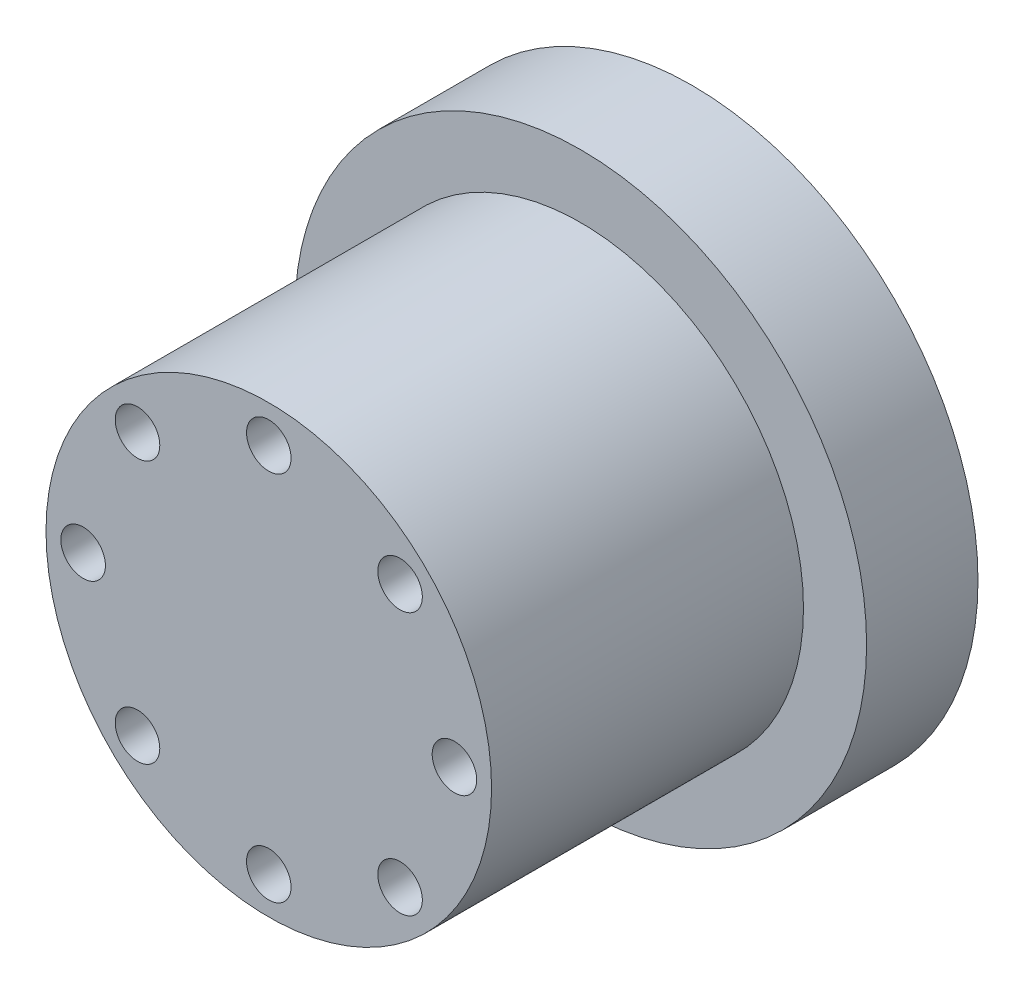
ISO-10303-21;
HEADER;
FILE_DESCRIPTION(('STEP AP214'),'2;1');
FILE_NAME('part.step','',(''),(''),'','','');
FILE_SCHEMA(('AUTOMOTIVE_DESIGN { 1 0 10303 214 1 1 1 1 }'));
ENDSEC;
DATA;
#1=APPLICATION_CONTEXT('core data for automotive mechanical design processes');
#2=APPLICATION_PROTOCOL_DEFINITION('international standard','automotive_design',2000,#1);
#3=PRODUCT_CONTEXT('',#1,'mechanical');
#4=PRODUCT('Part','Part','',(#3));
#5=PRODUCT_RELATED_PRODUCT_CATEGORY('part','',(#4));
#6=PRODUCT_DEFINITION_FORMATION('','',#4);
#7=PRODUCT_DEFINITION_CONTEXT('part definition',#1,'design');
#8=PRODUCT_DEFINITION('design','',#6,#7);
#9=PRODUCT_DEFINITION_SHAPE('','',#8);
#10=(LENGTH_UNIT() NAMED_UNIT(*) SI_UNIT(.MILLI.,.METRE.));
#11=(NAMED_UNIT(*) PLANE_ANGLE_UNIT() SI_UNIT($,.RADIAN.));
#12=(NAMED_UNIT(*) SI_UNIT($,.STERADIAN.) SOLID_ANGLE_UNIT());
#13=UNCERTAINTY_MEASURE_WITH_UNIT(LENGTH_MEASURE(1.E-05),#10,'distance_accuracy_value','');
#14=(GEOMETRIC_REPRESENTATION_CONTEXT(3) GLOBAL_UNCERTAINTY_ASSIGNED_CONTEXT((#13)) GLOBAL_UNIT_ASSIGNED_CONTEXT((#10,
#11,#12)) REPRESENTATION_CONTEXT('',''));
#15=CARTESIAN_POINT('',(0.,0.,0.));
#16=DIRECTION('',(0.,0.,1.));
#17=DIRECTION('',(1.,0.,0.));
#18=AXIS2_PLACEMENT_3D('',#15,#16,#17);
#19=CARTESIAN_POINT('',(0.,0.,42.));
#20=DIRECTION('',(0.,0.,-1.));
#21=DIRECTION('',(-1.,0.,0.));
#22=AXIS2_PLACEMENT_3D('',#19,#20,#21);
#23=CYLINDRICAL_SURFACE('',#22,30.);
#24=CARTESIAN_POINT('',(0.,0.,42.));
#25=DIRECTION('',(0.,0.,1.));
#26=DIRECTION('',(1.,0.,0.));
#27=AXIS2_PLACEMENT_3D('',#24,#25,#26);
#28=CIRCLE('',#27,30.);
#29=CARTESIAN_POINT('',(30.,0.,42.));
#30=VERTEX_POINT('',#29);
#31=EDGE_CURVE('E10',#30,#30,#28,.T.);
#32=ORIENTED_EDGE('',*,*,#31,.F.);
#33=EDGE_LOOP('',(#32));
#34=FACE_BOUND('',#33,.T.);
#35=CARTESIAN_POINT('',(0.,0.,0.));
#36=DIRECTION('',(0.,0.,1.));
#37=DIRECTION('',(1.,0.,0.));
#38=AXIS2_PLACEMENT_3D('',#35,#36,#37);
#39=CIRCLE('',#38,30.);
#40=CARTESIAN_POINT('',(30.,0.,0.));
#41=VERTEX_POINT('',#40);
#42=EDGE_CURVE('E37',#41,#41,#39,.T.);
#43=ORIENTED_EDGE('',*,*,#42,.T.);
#44=EDGE_LOOP('',(#43));
#45=FACE_BOUND('',#44,.T.);
#46=ADVANCED_FACE('F34',(#34,#45),#23,.T.);
#47=CARTESIAN_POINT('',(0.,0.,42.));
#48=DIRECTION('',(0.,0.,1.));
#49=DIRECTION('',(1.,0.,0.));
#50=AXIS2_PLACEMENT_3D('',#47,#48,#49);
#51=PLANE('',#50);
#52=CARTESIAN_POINT('',(0.,24.9999999999994,42.));
#53=DIRECTION('',(0.,0.,1.));
#54=DIRECTION('',(1.,0.,0.));
#55=AXIS2_PLACEMENT_3D('',#52,#53,#54);
#56=CIRCLE('',#55,3.);
#57=CARTESIAN_POINT('',(2.99999999999994,24.9999999999994,42.));
#58=VERTEX_POINT('',#57);
#59=EDGE_CURVE('E118',#58,#58,#56,.T.);
#60=ORIENTED_EDGE('',*,*,#59,.F.);
#61=EDGE_LOOP('',(#60));
#62=FACE_BOUND('',#61,.T.);
#63=CARTESIAN_POINT('',(17.6776695296635,17.6776695296639,42.));
#64=DIRECTION('',(0.,0.,1.));
#65=DIRECTION('',(1.,0.,0.));
#66=AXIS2_PLACEMENT_3D('',#63,#64,#65);
#67=CIRCLE('',#66,3.);
#68=CARTESIAN_POINT('',(20.6776695296635,17.6776695296639,42.));
#69=VERTEX_POINT('',#68);
#70=EDGE_CURVE('E112',#69,#69,#67,.T.);
#71=ORIENTED_EDGE('',*,*,#70,.F.);
#72=EDGE_LOOP('',(#71));
#73=FACE_BOUND('',#72,.T.);
#74=CARTESIAN_POINT('',(25.0000000000003,9.15325304873969E-13,42.));
#75=DIRECTION('',(0.,0.,1.));
#76=DIRECTION('',(1.,0.,0.));
#77=AXIS2_PLACEMENT_3D('',#74,#75,#76);
#78=CIRCLE('',#77,3.);
#79=CARTESIAN_POINT('',(28.0000000000003,9.15325304873969E-13,42.));
#80=VERTEX_POINT('',#79);
#81=EDGE_CURVE('E106',#80,#80,#78,.T.);
#82=ORIENTED_EDGE('',*,*,#81,.F.);
#83=EDGE_LOOP('',(#82));
#84=FACE_BOUND('',#83,.T.);
#85=CARTESIAN_POINT('',(17.6776695296648,-17.6776695296626,42.));
#86=DIRECTION('',(0.,0.,1.));
#87=DIRECTION('',(1.,0.,0.));
#88=AXIS2_PLACEMENT_3D('',#85,#86,#87);
#89=CIRCLE('',#88,3.);
#90=CARTESIAN_POINT('',(20.6776695296648,-17.6776695296626,42.));
#91=VERTEX_POINT('',#90);
#92=EDGE_CURVE('E100',#91,#91,#89,.T.);
#93=ORIENTED_EDGE('',*,*,#92,.F.);
#94=EDGE_LOOP('',(#93));
#95=FACE_BOUND('',#94,.T.);
#96=CARTESIAN_POINT('',(1.76583345588758E-12,-24.9999999999994,42.));
#97=DIRECTION('',(0.,0.,1.));
#98=DIRECTION('',(1.,0.,0.));
#99=AXIS2_PLACEMENT_3D('',#96,#97,#98);
#100=CIRCLE('',#99,3.);
#101=CARTESIAN_POINT('',(3.00000000000177,-24.9999999999994,42.));
#102=VERTEX_POINT('',#101);
#103=EDGE_CURVE('E94',#102,#102,#100,.T.);
#104=ORIENTED_EDGE('',*,*,#103,.F.);
#105=EDGE_LOOP('',(#104));
#106=FACE_BOUND('',#105,.T.);
#107=CARTESIAN_POINT('',(-17.6776695296618,-17.6776695296639,42.));
#108=DIRECTION('',(0.,0.,1.));
#109=DIRECTION('',(1.,0.,0.));
#110=AXIS2_PLACEMENT_3D('',#107,#108,#109);
#111=CIRCLE('',#110,3.);
#112=CARTESIAN_POINT('',(-14.6776695296618,-17.6776695296639,42.));
#113=VERTEX_POINT('',#112);
#114=EDGE_CURVE('E88',#113,#113,#111,.T.);
#115=ORIENTED_EDGE('',*,*,#114,.F.);
#116=EDGE_LOOP('',(#115));
#117=FACE_BOUND('',#116,.T.);
#118=CARTESIAN_POINT('',(-24.9999999999986,-9.18386921871838E-13,42.));
#119=DIRECTION('',(0.,0.,1.));
#120=DIRECTION('',(1.,0.,0.));
#121=AXIS2_PLACEMENT_3D('',#118,#119,#120);
#122=CIRCLE('',#121,3.);
#123=CARTESIAN_POINT('',(-21.9999999999985,-9.18386921871838E-13,42.));
#124=VERTEX_POINT('',#123);
#125=EDGE_CURVE('E82',#124,#124,#122,.T.);
#126=ORIENTED_EDGE('',*,*,#125,.F.);
#127=EDGE_LOOP('',(#126));
#128=FACE_BOUND('',#127,.T.);
#129=CARTESIAN_POINT('',(-17.6776695296631,17.6776695296626,42.));
#130=DIRECTION('',(0.,0.,1.));
#131=DIRECTION('',(1.,0.,0.));
#132=AXIS2_PLACEMENT_3D('',#129,#130,#131);
#133=CIRCLE('',#132,3.);
#134=CARTESIAN_POINT('',(-14.6776695296631,17.6776695296626,42.));
#135=VERTEX_POINT('',#134);
#136=EDGE_CURVE('E76',#135,#135,#133,.T.);
#137=ORIENTED_EDGE('',*,*,#136,.F.);
#138=EDGE_LOOP('',(#137));
#139=FACE_BOUND('',#138,.T.);
#140=ORIENTED_EDGE('',*,*,#31,.T.);
#141=EDGE_LOOP('',(#140));
#142=FACE_BOUND('',#141,.T.);
#143=ADVANCED_FACE('F133',(#62,#73,#84,#95,#106,#117,#128,#139,#142),#51,.T.);
#144=CARTESIAN_POINT('',(0.,0.,-15.));
#145=DIRECTION('',(0.,0.,1.));
#146=DIRECTION('',(1.,0.,0.));
#147=AXIS2_PLACEMENT_3D('',#144,#145,#146);
#148=CYLINDRICAL_SURFACE('',#147,38.5);
#149=CARTESIAN_POINT('',(0.,0.,-15.));
#150=DIRECTION('',(0.,0.,1.));
#151=DIRECTION('',(1.,0.,0.));
#152=AXIS2_PLACEMENT_3D('',#149,#150,#151);
#153=CIRCLE('',#152,38.5);
#154=CARTESIAN_POINT('',(38.5,0.,-15.));
#155=VERTEX_POINT('',#154);
#156=EDGE_CURVE('E44',#155,#155,#153,.T.);
#157=ORIENTED_EDGE('',*,*,#156,.T.);
#158=EDGE_LOOP('',(#157));
#159=FACE_BOUND('',#158,.T.);
#160=CARTESIAN_POINT('',(0.,0.,0.));
#161=DIRECTION('',(0.,0.,1.));
#162=DIRECTION('',(1.,0.,0.));
#163=AXIS2_PLACEMENT_3D('',#160,#161,#162);
#164=CIRCLE('',#163,38.5);
#165=CARTESIAN_POINT('',(38.5,0.,0.));
#166=VERTEX_POINT('',#165);
#167=EDGE_CURVE('E46',#166,#166,#164,.T.);
#168=ORIENTED_EDGE('',*,*,#167,.F.);
#169=EDGE_LOOP('',(#168));
#170=FACE_BOUND('',#169,.T.);
#171=ADVANCED_FACE('F136',(#159,#170),#148,.T.);
#172=CARTESIAN_POINT('',(0.,0.,-15.));
#173=DIRECTION('',(0.,0.,1.));
#174=DIRECTION('',(1.,0.,0.));
#175=AXIS2_PLACEMENT_3D('',#172,#173,#174);
#176=PLANE('',#175);
#177=CARTESIAN_POINT('',(0.,25.,-15.));
#178=DIRECTION('',(0.,0.,-1.));
#179=DIRECTION('',(-1.,0.,0.));
#180=AXIS2_PLACEMENT_3D('',#177,#178,#179);
#181=CIRCLE('',#180,3.);
#182=CARTESIAN_POINT('',(-3.,25.,-15.));
#183=VERTEX_POINT('',#182);
#184=EDGE_CURVE('E71',#183,#183,#181,.T.);
#185=ORIENTED_EDGE('',*,*,#184,.F.);
#186=EDGE_LOOP('',(#185));
#187=FACE_BOUND('',#186,.T.);
#188=CARTESIAN_POINT('',(-25.0000000000007,7.07481118762232E-13,-15.));
#189=DIRECTION('',(0.,0.,-1.));
#190=DIRECTION('',(-1.,0.,0.));
#191=AXIS2_PLACEMENT_3D('',#188,#189,#190);
#192=CIRCLE('',#191,3.00000000000055);
#193=CARTESIAN_POINT('',(-28.0000000000013,7.07481118762232E-13,-15.));
#194=VERTEX_POINT('',#193);
#195=EDGE_CURVE('E65',#194,#194,#192,.T.);
#196=ORIENTED_EDGE('',*,*,#195,.F.);
#197=EDGE_LOOP('',(#196));
#198=FACE_BOUND('',#197,.T.);
#199=CARTESIAN_POINT('',(-1.41496223752446E-12,-25.,-15.));
#200=DIRECTION('',(0.,0.,-1.));
#201=DIRECTION('',(-1.,0.,0.));
#202=AXIS2_PLACEMENT_3D('',#199,#200,#201);
#203=CIRCLE('',#202,3.00000000000152);
#204=CARTESIAN_POINT('',(-3.00000000000294,-25.,-15.));
#205=VERTEX_POINT('',#204);
#206=EDGE_CURVE('E59',#205,#205,#203,.T.);
#207=ORIENTED_EDGE('',*,*,#206,.F.);
#208=EDGE_LOOP('',(#207));
#209=FACE_BOUND('',#208,.T.);
#210=CARTESIAN_POINT('',(24.9999999999993,-7.105427357601E-13,-15.));
#211=DIRECTION('',(0.,0.,-1.));
#212=DIRECTION('',(-1.,0.,0.));
#213=AXIS2_PLACEMENT_3D('',#210,#211,#212);
#214=CIRCLE('',#213,3.00000000000113);
#215=CARTESIAN_POINT('',(21.9999999999982,-7.105427357601E-13,-15.));
#216=VERTEX_POINT('',#215);
#217=EDGE_CURVE('E52',#216,#216,#214,.T.);
#218=ORIENTED_EDGE('',*,*,#217,.F.);
#219=EDGE_LOOP('',(#218));
#220=FACE_BOUND('',#219,.T.);
#221=ORIENTED_EDGE('',*,*,#156,.F.);
#222=EDGE_LOOP('',(#221));
#223=FACE_BOUND('',#222,.T.);
#224=ADVANCED_FACE('F179',(#187,#198,#209,#220,#223),#176,.F.);
#225=CARTESIAN_POINT('',(0.,0.,0.));
#226=DIRECTION('',(0.,0.,1.));
#227=DIRECTION('',(1.,0.,0.));
#228=AXIS2_PLACEMENT_3D('',#225,#226,#227);
#229=PLANE('',#228);
#230=ORIENTED_EDGE('',*,*,#42,.F.);
#231=EDGE_LOOP('',(#230));
#232=FACE_BOUND('',#231,.T.);
#233=ORIENTED_EDGE('',*,*,#167,.T.);
#234=EDGE_LOOP('',(#233));
#235=FACE_BOUND('',#234,.T.);
#236=ADVANCED_FACE('F175',(#232,#235),#229,.T.);
#237=CARTESIAN_POINT('',(24.9999999999993,-7.105427357601E-13,-5.));
#238=DIRECTION('',(0.,0.,-1.));
#239=DIRECTION('',(-1.,0.,0.));
#240=AXIS2_PLACEMENT_3D('',#237,#238,#239);
#241=CYLINDRICAL_SURFACE('',#240,3.00000000000113);
#242=CARTESIAN_POINT('',(24.9999999999993,-7.105427357601E-13,-5.));
#243=DIRECTION('',(0.,0.,-1.));
#244=DIRECTION('',(-1.,0.,0.));
#245=AXIS2_PLACEMENT_3D('',#242,#243,#244);
#246=CIRCLE('',#245,3.00000000000113);
#247=CARTESIAN_POINT('',(21.9999999999982,-7.105427357601E-13,-5.));
#248=VERTEX_POINT('',#247);
#249=EDGE_CURVE('E55',#248,#248,#246,.T.);
#250=ORIENTED_EDGE('',*,*,#249,.F.);
#251=EDGE_LOOP('',(#250));
#252=FACE_BOUND('',#251,.T.);
#253=ORIENTED_EDGE('',*,*,#217,.T.);
#254=EDGE_LOOP('',(#253));
#255=FACE_BOUND('',#254,.T.);
#256=ADVANCED_FACE('F178',(#252,#255),#241,.F.);
#257=CARTESIAN_POINT('',(24.9999999999993,-7.105427357601E-13,-5.));
#258=DIRECTION('',(0.,0.,-1.));
#259=DIRECTION('',(-1.,0.,0.));
#260=AXIS2_PLACEMENT_3D('',#257,#258,#259);
#261=PLANE('',#260);
#262=ORIENTED_EDGE('',*,*,#249,.T.);
#263=EDGE_LOOP('',(#262));
#264=FACE_BOUND('',#263,.T.);
#265=ADVANCED_FACE('F194',(#264),#261,.T.);
#266=CARTESIAN_POINT('',(-1.41496223752446E-12,-25.,-5.));
#267=DIRECTION('',(0.,0.,-1.));
#268=DIRECTION('',(-1.,0.,0.));
#269=AXIS2_PLACEMENT_3D('',#266,#267,#268);
#270=CYLINDRICAL_SURFACE('',#269,3.00000000000152);
#271=CARTESIAN_POINT('',(-1.41496223752446E-12,-25.,-5.));
#272=DIRECTION('',(0.,0.,-1.));
#273=DIRECTION('',(-1.,0.,0.));
#274=AXIS2_PLACEMENT_3D('',#271,#272,#273);
#275=CIRCLE('',#274,3.00000000000152);
#276=CARTESIAN_POINT('',(-3.00000000000294,-25.,-5.));
#277=VERTEX_POINT('',#276);
#278=EDGE_CURVE('E62',#277,#277,#275,.T.);
#279=ORIENTED_EDGE('',*,*,#278,.F.);
#280=EDGE_LOOP('',(#279));
#281=FACE_BOUND('',#280,.T.);
#282=ORIENTED_EDGE('',*,*,#206,.T.);
#283=EDGE_LOOP('',(#282));
#284=FACE_BOUND('',#283,.T.);
#285=ADVANCED_FACE('F198',(#281,#284),#270,.F.);
#286=CARTESIAN_POINT('',(-1.41496223752446E-12,-25.,-5.));
#287=DIRECTION('',(0.,0.,-1.));
#288=DIRECTION('',(-1.,0.,0.));
#289=AXIS2_PLACEMENT_3D('',#286,#287,#288);
#290=PLANE('',#289);
#291=ORIENTED_EDGE('',*,*,#278,.T.);
#292=EDGE_LOOP('',(#291));
#293=FACE_BOUND('',#292,.T.);
#294=ADVANCED_FACE('F202',(#293),#290,.T.);
#295=CARTESIAN_POINT('',(-25.0000000000007,7.07481118762232E-13,-5.));
#296=DIRECTION('',(0.,0.,-1.));
#297=DIRECTION('',(-1.,0.,0.));
#298=AXIS2_PLACEMENT_3D('',#295,#296,#297);
#299=CYLINDRICAL_SURFACE('',#298,3.00000000000055);
#300=CARTESIAN_POINT('',(-25.0000000000007,7.07481118762232E-13,-5.));
#301=DIRECTION('',(0.,0.,-1.));
#302=DIRECTION('',(-1.,0.,0.));
#303=AXIS2_PLACEMENT_3D('',#300,#301,#302);
#304=CIRCLE('',#303,3.00000000000055);
#305=CARTESIAN_POINT('',(-28.0000000000013,7.07481118762232E-13,-5.));
#306=VERTEX_POINT('',#305);
#307=EDGE_CURVE('E68',#306,#306,#304,.T.);
#308=ORIENTED_EDGE('',*,*,#307,.F.);
#309=EDGE_LOOP('',(#308));
#310=FACE_BOUND('',#309,.T.);
#311=ORIENTED_EDGE('',*,*,#195,.T.);
#312=EDGE_LOOP('',(#311));
#313=FACE_BOUND('',#312,.T.);
#314=ADVANCED_FACE('F206',(#310,#313),#299,.F.);
#315=CARTESIAN_POINT('',(-25.0000000000007,7.07481118762232E-13,-5.));
#316=DIRECTION('',(0.,0.,-1.));
#317=DIRECTION('',(-1.,0.,0.));
#318=AXIS2_PLACEMENT_3D('',#315,#316,#317);
#319=PLANE('',#318);
#320=ORIENTED_EDGE('',*,*,#307,.T.);
#321=EDGE_LOOP('',(#320));
#322=FACE_BOUND('',#321,.T.);
#323=ADVANCED_FACE('F210',(#322),#319,.T.);
#324=CARTESIAN_POINT('',(0.,25.,-5.));
#325=DIRECTION('',(0.,0.,-1.));
#326=DIRECTION('',(-1.,0.,0.));
#327=AXIS2_PLACEMENT_3D('',#324,#325,#326);
#328=CYLINDRICAL_SURFACE('',#327,3.);
#329=CARTESIAN_POINT('',(0.,25.,-5.));
#330=DIRECTION('',(0.,0.,-1.));
#331=DIRECTION('',(-1.,0.,0.));
#332=AXIS2_PLACEMENT_3D('',#329,#330,#331);
#333=CIRCLE('',#332,3.);
#334=CARTESIAN_POINT('',(-3.,25.,-5.));
#335=VERTEX_POINT('',#334);
#336=EDGE_CURVE('E49',#335,#335,#333,.T.);
#337=ORIENTED_EDGE('',*,*,#336,.F.);
#338=EDGE_LOOP('',(#337));
#339=FACE_BOUND('',#338,.T.);
#340=ORIENTED_EDGE('',*,*,#184,.T.);
#341=EDGE_LOOP('',(#340));
#342=FACE_BOUND('',#341,.T.);
#343=ADVANCED_FACE('F164',(#339,#342),#328,.F.);
#344=CARTESIAN_POINT('',(0.,25.,-5.));
#345=DIRECTION('',(0.,0.,-1.));
#346=DIRECTION('',(-1.,0.,0.));
#347=AXIS2_PLACEMENT_3D('',#344,#345,#346);
#348=PLANE('',#347);
#349=ORIENTED_EDGE('',*,*,#336,.T.);
#350=EDGE_LOOP('',(#349));
#351=FACE_BOUND('',#350,.T.);
#352=ADVANCED_FACE('F154',(#351),#348,.T.);
#353=CARTESIAN_POINT('',(-17.6776695296631,17.6776695296626,32.));
#354=DIRECTION('',(0.,0.,1.));
#355=DIRECTION('',(1.,0.,0.));
#356=AXIS2_PLACEMENT_3D('',#353,#354,#355);
#357=CYLINDRICAL_SURFACE('',#356,3.);
#358=CARTESIAN_POINT('',(-17.6776695296631,17.6776695296626,32.));
#359=DIRECTION('',(0.,0.,1.));
#360=DIRECTION('',(1.,0.,0.));
#361=AXIS2_PLACEMENT_3D('',#358,#359,#360);
#362=CIRCLE('',#361,3.);
#363=CARTESIAN_POINT('',(-14.6776695296631,17.6776695296626,32.));
#364=VERTEX_POINT('',#363);
#365=EDGE_CURVE('E79',#364,#364,#362,.T.);
#366=ORIENTED_EDGE('',*,*,#365,.F.);
#367=EDGE_LOOP('',(#366));
#368=FACE_BOUND('',#367,.T.);
#369=ORIENTED_EDGE('',*,*,#136,.T.);
#370=EDGE_LOOP('',(#369));
#371=FACE_BOUND('',#370,.T.);
#372=ADVANCED_FACE('F151',(#368,#371),#357,.F.);
#373=CARTESIAN_POINT('',(-17.6776695296631,17.6776695296626,32.));
#374=DIRECTION('',(0.,0.,1.));
#375=DIRECTION('',(1.,0.,0.));
#376=AXIS2_PLACEMENT_3D('',#373,#374,#375);
#377=PLANE('',#376);
#378=ORIENTED_EDGE('',*,*,#365,.T.);
#379=EDGE_LOOP('',(#378));
#380=FACE_BOUND('',#379,.T.);
#381=ADVANCED_FACE('F153',(#380),#377,.T.);
#382=CARTESIAN_POINT('',(-24.9999999999986,-9.18386921871838E-13,32.));
#383=DIRECTION('',(0.,0.,1.));
#384=DIRECTION('',(1.,0.,0.));
#385=AXIS2_PLACEMENT_3D('',#382,#383,#384);
#386=CYLINDRICAL_SURFACE('',#385,3.);
#387=CARTESIAN_POINT('',(-24.9999999999986,-9.18386921871838E-13,32.));
#388=DIRECTION('',(0.,0.,1.));
#389=DIRECTION('',(1.,0.,0.));
#390=AXIS2_PLACEMENT_3D('',#387,#388,#389);
#391=CIRCLE('',#390,3.);
#392=CARTESIAN_POINT('',(-21.9999999999985,-9.18386921871838E-13,32.));
#393=VERTEX_POINT('',#392);
#394=EDGE_CURVE('E85',#393,#393,#391,.T.);
#395=ORIENTED_EDGE('',*,*,#394,.F.);
#396=EDGE_LOOP('',(#395));
#397=FACE_BOUND('',#396,.T.);
#398=ORIENTED_EDGE('',*,*,#125,.T.);
#399=EDGE_LOOP('',(#398));
#400=FACE_BOUND('',#399,.T.);
#401=ADVANCED_FACE('F161',(#397,#400),#386,.F.);
#402=CARTESIAN_POINT('',(-24.9999999999986,-9.18386921871838E-13,32.));
#403=DIRECTION('',(0.,0.,1.));
#404=DIRECTION('',(1.,0.,0.));
#405=AXIS2_PLACEMENT_3D('',#402,#403,#404);
#406=PLANE('',#405);
#407=ORIENTED_EDGE('',*,*,#394,.T.);
#408=EDGE_LOOP('',(#407));
#409=FACE_BOUND('',#408,.T.);
#410=ADVANCED_FACE('F266',(#409),#406,.T.);
#411=CARTESIAN_POINT('',(-17.6776695296618,-17.6776695296639,32.));
#412=DIRECTION('',(0.,0.,1.));
#413=DIRECTION('',(1.,0.,0.));
#414=AXIS2_PLACEMENT_3D('',#411,#412,#413);
#415=CYLINDRICAL_SURFACE('',#414,3.);
#416=CARTESIAN_POINT('',(-17.6776695296618,-17.6776695296639,32.));
#417=DIRECTION('',(0.,0.,1.));
#418=DIRECTION('',(1.,0.,0.));
#419=AXIS2_PLACEMENT_3D('',#416,#417,#418);
#420=CIRCLE('',#419,3.);
#421=CARTESIAN_POINT('',(-14.6776695296618,-17.6776695296639,32.));
#422=VERTEX_POINT('',#421);
#423=EDGE_CURVE('E91',#422,#422,#420,.T.);
#424=ORIENTED_EDGE('',*,*,#423,.F.);
#425=EDGE_LOOP('',(#424));
#426=FACE_BOUND('',#425,.T.);
#427=ORIENTED_EDGE('',*,*,#114,.T.);
#428=EDGE_LOOP('',(#427));
#429=FACE_BOUND('',#428,.T.);
#430=ADVANCED_FACE('F276',(#426,#429),#415,.F.);
#431=CARTESIAN_POINT('',(-17.6776695296618,-17.6776695296639,32.));
#432=DIRECTION('',(0.,0.,1.));
#433=DIRECTION('',(1.,0.,0.));
#434=AXIS2_PLACEMENT_3D('',#431,#432,#433);
#435=PLANE('',#434);
#436=ORIENTED_EDGE('',*,*,#423,.T.);
#437=EDGE_LOOP('',(#436));
#438=FACE_BOUND('',#437,.T.);
#439=ADVANCED_FACE('F286',(#438),#435,.T.);
#440=CARTESIAN_POINT('',(1.76583345588758E-12,-24.9999999999994,32.));
#441=DIRECTION('',(0.,0.,1.));
#442=DIRECTION('',(1.,0.,0.));
#443=AXIS2_PLACEMENT_3D('',#440,#441,#442);
#444=CYLINDRICAL_SURFACE('',#443,3.);
#445=CARTESIAN_POINT('',(1.76583345588758E-12,-24.9999999999994,32.));
#446=DIRECTION('',(0.,0.,1.));
#447=DIRECTION('',(1.,0.,0.));
#448=AXIS2_PLACEMENT_3D('',#445,#446,#447);
#449=CIRCLE('',#448,3.);
#450=CARTESIAN_POINT('',(3.00000000000177,-24.9999999999994,32.));
#451=VERTEX_POINT('',#450);
#452=EDGE_CURVE('E97',#451,#451,#449,.T.);
#453=ORIENTED_EDGE('',*,*,#452,.F.);
#454=EDGE_LOOP('',(#453));
#455=FACE_BOUND('',#454,.T.);
#456=ORIENTED_EDGE('',*,*,#103,.T.);
#457=EDGE_LOOP('',(#456));
#458=FACE_BOUND('',#457,.T.);
#459=ADVANCED_FACE('F296',(#455,#458),#444,.F.);
#460=CARTESIAN_POINT('',(1.76583345588758E-12,-24.9999999999994,32.));
#461=DIRECTION('',(0.,0.,1.));
#462=DIRECTION('',(1.,0.,0.));
#463=AXIS2_PLACEMENT_3D('',#460,#461,#462);
#464=PLANE('',#463);
#465=ORIENTED_EDGE('',*,*,#452,.T.);
#466=EDGE_LOOP('',(#465));
#467=FACE_BOUND('',#466,.T.);
#468=ADVANCED_FACE('F306',(#467),#464,.T.);
#469=CARTESIAN_POINT('',(17.6776695296648,-17.6776695296626,32.));
#470=DIRECTION('',(0.,0.,1.));
#471=DIRECTION('',(1.,0.,0.));
#472=AXIS2_PLACEMENT_3D('',#469,#470,#471);
#473=CYLINDRICAL_SURFACE('',#472,3.);
#474=CARTESIAN_POINT('',(17.6776695296648,-17.6776695296626,32.));
#475=DIRECTION('',(0.,0.,1.));
#476=DIRECTION('',(1.,0.,0.));
#477=AXIS2_PLACEMENT_3D('',#474,#475,#476);
#478=CIRCLE('',#477,3.);
#479=CARTESIAN_POINT('',(20.6776695296648,-17.6776695296626,32.));
#480=VERTEX_POINT('',#479);
#481=EDGE_CURVE('E103',#480,#480,#478,.T.);
#482=ORIENTED_EDGE('',*,*,#481,.F.);
#483=EDGE_LOOP('',(#482));
#484=FACE_BOUND('',#483,.T.);
#485=ORIENTED_EDGE('',*,*,#92,.T.);
#486=EDGE_LOOP('',(#485));
#487=FACE_BOUND('',#486,.T.);
#488=ADVANCED_FACE('F316',(#484,#487),#473,.F.);
#489=CARTESIAN_POINT('',(17.6776695296648,-17.6776695296626,32.));
#490=DIRECTION('',(0.,0.,1.));
#491=DIRECTION('',(1.,0.,0.));
#492=AXIS2_PLACEMENT_3D('',#489,#490,#491);
#493=PLANE('',#492);
#494=ORIENTED_EDGE('',*,*,#481,.T.);
#495=EDGE_LOOP('',(#494));
#496=FACE_BOUND('',#495,.T.);
#497=ADVANCED_FACE('F326',(#496),#493,.T.);
#498=CARTESIAN_POINT('',(25.0000000000003,9.15325304873969E-13,32.));
#499=DIRECTION('',(0.,0.,1.));
#500=DIRECTION('',(1.,0.,0.));
#501=AXIS2_PLACEMENT_3D('',#498,#499,#500);
#502=CYLINDRICAL_SURFACE('',#501,3.);
#503=CARTESIAN_POINT('',(25.0000000000003,9.15325304873969E-13,32.));
#504=DIRECTION('',(0.,0.,1.));
#505=DIRECTION('',(1.,0.,0.));
#506=AXIS2_PLACEMENT_3D('',#503,#504,#505);
#507=CIRCLE('',#506,3.);
#508=CARTESIAN_POINT('',(28.0000000000003,9.15325304873969E-13,32.));
#509=VERTEX_POINT('',#508);
#510=EDGE_CURVE('E109',#509,#509,#507,.T.);
#511=ORIENTED_EDGE('',*,*,#510,.F.);
#512=EDGE_LOOP('',(#511));
#513=FACE_BOUND('',#512,.T.);
#514=ORIENTED_EDGE('',*,*,#81,.T.);
#515=EDGE_LOOP('',(#514));
#516=FACE_BOUND('',#515,.T.);
#517=ADVANCED_FACE('F336',(#513,#516),#502,.F.);
#518=CARTESIAN_POINT('',(25.0000000000003,9.15325304873969E-13,32.));
#519=DIRECTION('',(0.,0.,1.));
#520=DIRECTION('',(1.,0.,0.));
#521=AXIS2_PLACEMENT_3D('',#518,#519,#520);
#522=PLANE('',#521);
#523=ORIENTED_EDGE('',*,*,#510,.T.);
#524=EDGE_LOOP('',(#523));
#525=FACE_BOUND('',#524,.T.);
#526=ADVANCED_FACE('F346',(#525),#522,.T.);
#527=CARTESIAN_POINT('',(17.6776695296635,17.6776695296639,32.));
#528=DIRECTION('',(0.,0.,1.));
#529=DIRECTION('',(1.,0.,0.));
#530=AXIS2_PLACEMENT_3D('',#527,#528,#529);
#531=CYLINDRICAL_SURFACE('',#530,3.);
#532=CARTESIAN_POINT('',(17.6776695296635,17.6776695296639,32.));
#533=DIRECTION('',(0.,0.,1.));
#534=DIRECTION('',(1.,0.,0.));
#535=AXIS2_PLACEMENT_3D('',#532,#533,#534);
#536=CIRCLE('',#535,3.);
#537=CARTESIAN_POINT('',(20.6776695296635,17.6776695296639,32.));
#538=VERTEX_POINT('',#537);
#539=EDGE_CURVE('E115',#538,#538,#536,.T.);
#540=ORIENTED_EDGE('',*,*,#539,.F.);
#541=EDGE_LOOP('',(#540));
#542=FACE_BOUND('',#541,.T.);
#543=ORIENTED_EDGE('',*,*,#70,.T.);
#544=EDGE_LOOP('',(#543));
#545=FACE_BOUND('',#544,.T.);
#546=ADVANCED_FACE('F356',(#542,#545),#531,.F.);
#547=CARTESIAN_POINT('',(17.6776695296635,17.6776695296639,32.));
#548=DIRECTION('',(0.,0.,1.));
#549=DIRECTION('',(1.,0.,0.));
#550=AXIS2_PLACEMENT_3D('',#547,#548,#549);
#551=PLANE('',#550);
#552=ORIENTED_EDGE('',*,*,#539,.T.);
#553=EDGE_LOOP('',(#552));
#554=FACE_BOUND('',#553,.T.);
#555=ADVANCED_FACE('F129',(#554),#551,.T.);
#556=CARTESIAN_POINT('',(0.,24.9999999999994,32.));
#557=DIRECTION('',(0.,0.,1.));
#558=DIRECTION('',(1.,0.,0.));
#559=AXIS2_PLACEMENT_3D('',#556,#557,#558);
#560=CYLINDRICAL_SURFACE('',#559,3.);
#561=CARTESIAN_POINT('',(0.,24.9999999999994,32.));
#562=DIRECTION('',(0.,0.,1.));
#563=DIRECTION('',(1.,0.,0.));
#564=AXIS2_PLACEMENT_3D('',#561,#562,#563);
#565=CIRCLE('',#564,3.);
#566=CARTESIAN_POINT('',(2.99999999999994,24.9999999999994,32.));
#567=VERTEX_POINT('',#566);
#568=EDGE_CURVE('E56',#567,#567,#565,.T.);
#569=ORIENTED_EDGE('',*,*,#568,.F.);
#570=EDGE_LOOP('',(#569));
#571=FACE_BOUND('',#570,.T.);
#572=ORIENTED_EDGE('',*,*,#59,.T.);
#573=EDGE_LOOP('',(#572));
#574=FACE_BOUND('',#573,.T.);
#575=ADVANCED_FACE('F126',(#571,#574),#560,.F.);
#576=CARTESIAN_POINT('',(0.,24.9999999999994,32.));
#577=DIRECTION('',(0.,0.,1.));
#578=DIRECTION('',(1.,0.,0.));
#579=AXIS2_PLACEMENT_3D('',#576,#577,#578);
#580=PLANE('',#579);
#581=ORIENTED_EDGE('',*,*,#568,.T.);
#582=EDGE_LOOP('',(#581));
#583=FACE_BOUND('',#582,.T.);
#584=ADVANCED_FACE('F124',(#583),#580,.T.);
#585=CLOSED_SHELL('',(#46,#143,#171,#224,#236,#256,#265,#285,#294,#314,#323,#343,#352,#372,#381,
#401,#410,#430,#439,#459,#468,#488,#497,#517,#526,#546,#555,#575,#584));
#586=MANIFOLD_SOLID_BREP('B2',#585);
#587=ADVANCED_BREP_SHAPE_REPRESENTATION('',(#18,#586),#14);
#588=SHAPE_DEFINITION_REPRESENTATION(#9,#587);
ENDSEC;
END-ISO-10303-21;
